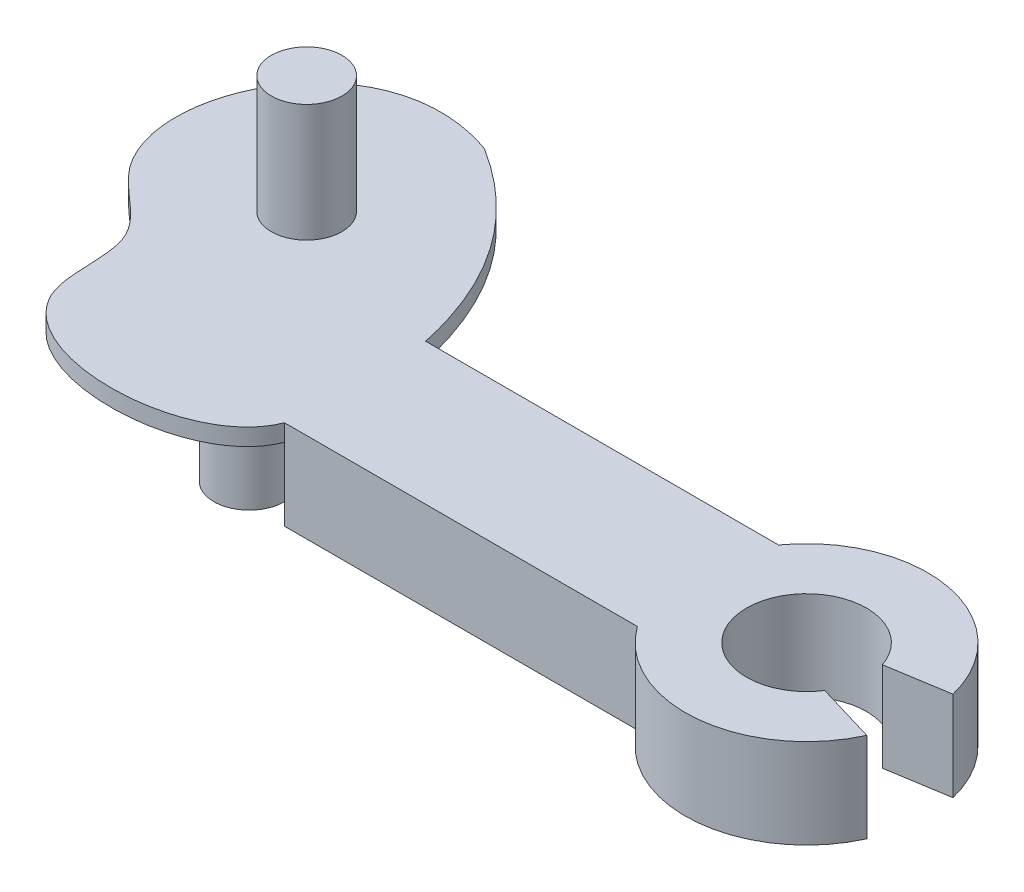
ISO-10303-21;
HEADER;
FILE_DESCRIPTION(('STEP AP214'),'2;1');
FILE_NAME('part.step','',(''),(''),'','','');
FILE_SCHEMA(('AUTOMOTIVE_DESIGN { 1 0 10303 214 1 1 1 1 }'));
ENDSEC;
DATA;
#1=APPLICATION_CONTEXT('core data for automotive mechanical design processes');
#2=APPLICATION_PROTOCOL_DEFINITION('international standard','automotive_design',2000,#1);
#3=PRODUCT_CONTEXT('',#1,'mechanical');
#4=PRODUCT('Part','Part','',(#3));
#5=PRODUCT_RELATED_PRODUCT_CATEGORY('part','',(#4));
#6=PRODUCT_DEFINITION_FORMATION('','',#4);
#7=PRODUCT_DEFINITION_CONTEXT('part definition',#1,'design');
#8=PRODUCT_DEFINITION('design','',#6,#7);
#9=PRODUCT_DEFINITION_SHAPE('','',#8);
#10=(LENGTH_UNIT() NAMED_UNIT(*) SI_UNIT(.MILLI.,.METRE.));
#11=(NAMED_UNIT(*) PLANE_ANGLE_UNIT() SI_UNIT($,.RADIAN.));
#12=(NAMED_UNIT(*) SI_UNIT($,.STERADIAN.) SOLID_ANGLE_UNIT());
#13=UNCERTAINTY_MEASURE_WITH_UNIT(LENGTH_MEASURE(1.E-05),#10,'distance_accuracy_value','');
#14=(GEOMETRIC_REPRESENTATION_CONTEXT(3) GLOBAL_UNCERTAINTY_ASSIGNED_CONTEXT((#13)) GLOBAL_UNIT_ASSIGNED_CONTEXT((#10,
#11,#12)) REPRESENTATION_CONTEXT('',''));
#15=CARTESIAN_POINT('',(0.,0.,0.));
#16=DIRECTION('',(0.,0.,1.));
#17=DIRECTION('',(1.,0.,0.));
#18=AXIS2_PLACEMENT_3D('',#15,#16,#17);
#19=CARTESIAN_POINT('',(0.,0.,0.));
#20=DIRECTION('',(0.,1.,0.));
#21=DIRECTION('',(0.,0.,1.));
#22=AXIS2_PLACEMENT_3D('',#19,#20,#21);
#23=PLANE('',#22);
#24=CARTESIAN_POINT('',(0.,0.,-2.));
#25=CARTESIAN_POINT('',(2.17515280569474,0.,-0.238184258237294));
#26=CARTESIAN_POINT('',(0.,0.,2.));
#27=B_SPLINE_CURVE_WITH_KNOTS('',2,(#24,#25,#26),.UNSPECIFIED.,.F.,.F.,(3,3),(0.,1.),.UNSPECIFIED.);
#28=CARTESIAN_POINT('',(0.,0.,-2.));
#29=VERTEX_POINT('',#28);
#30=CARTESIAN_POINT('',(0.,0.,2.));
#31=VERTEX_POINT('',#30);
#32=EDGE_CURVE('E11',#29,#31,#27,.T.);
#33=ORIENTED_EDGE('',*,*,#32,.F.);
#34=DIRECTION('',(-1.,0.,0.));
#35=VECTOR('',#34,1.);
#36=CARTESIAN_POINT('',(0.,0.,-2.));
#37=LINE('',#36,#35);
#38=CARTESIAN_POINT('',(10.,0.,-2.));
#39=VERTEX_POINT('',#38);
#40=EDGE_CURVE('E155',#39,#29,#37,.T.);
#41=ORIENTED_EDGE('',*,*,#40,.F.);
#42=CARTESIAN_POINT('',(12.794,0.,0.));
#43=DIRECTION('',(0.,1.,0.));
#44=DIRECTION('',(0.,0.,1.));
#45=AXIS2_PLACEMENT_3D('',#42,#43,#44);
#46=CIRCLE('',#45,3.43604947577883);
#47=CARTESIAN_POINT('',(16.1331889635571,0.,-0.810094479464426));
#48=VERTEX_POINT('',#47);
#49=EDGE_CURVE('E152',#39,#48,#46,.F.);
#50=ORIENTED_EDGE('',*,*,#49,.T.);
#51=DIRECTION('',(-0.987239256673568,0.,0.159243995436628));
#52=VECTOR('',#51,1.);
#53=CARTESIAN_POINT('',(0.281759382160779,0.,1.74677809510191));
#54=LINE('',#53,#52);
#55=CARTESIAN_POINT('',(14.408639420947,0.,-0.531920614682185));
#56=VERTEX_POINT('',#55);
#57=EDGE_CURVE('E148',#48,#56,#54,.T.);
#58=ORIENTED_EDGE('',*,*,#57,.T.);
#59=CARTESIAN_POINT('',(12.794,0.,0.));
#60=DIRECTION('',(0.,1.,0.));
#61=DIRECTION('',(0.,0.,1.));
#62=AXIS2_PLACEMENT_3D('',#59,#60,#61);
#63=CIRCLE('',#62,1.7);
#64=CARTESIAN_POINT('',(14.2261023097936,0.,0.916014723835713));
#65=VERTEX_POINT('',#64);
#66=EDGE_CURVE('E145',#65,#56,#63,.F.);
#67=ORIENTED_EDGE('',*,*,#66,.F.);
#68=DIRECTION('',(-0.958395292809104,0.,-0.285444325081709));
#69=VECTOR('',#68,1.);
#70=CARTESIAN_POINT('',(0.908528175015129,0.,-3.05043418211133));
#71=LINE('',#70,#69);
#72=CARTESIAN_POINT('',(15.9223503044234,0.,1.42121791883381));
#73=VERTEX_POINT('',#72);
#74=EDGE_CURVE('E87',#73,#65,#71,.T.);
#75=ORIENTED_EDGE('',*,*,#74,.F.);
#76=CARTESIAN_POINT('',(12.794,0.,0.));
#77=DIRECTION('',(0.,1.,0.));
#78=DIRECTION('',(0.,0.,1.));
#79=AXIS2_PLACEMENT_3D('',#76,#77,#78);
#80=CIRCLE('',#79,3.43604947577883);
#81=CARTESIAN_POINT('',(10.,0.,2.));
#82=VERTEX_POINT('',#81);
#83=EDGE_CURVE('E81',#82,#73,#80,.T.);
#84=ORIENTED_EDGE('',*,*,#83,.F.);
#85=DIRECTION('',(-1.,0.,0.));
#86=VECTOR('',#85,1.);
#87=CARTESIAN_POINT('',(0.,0.,2.));
#88=LINE('',#87,#86);
#89=EDGE_CURVE('E123',#82,#31,#88,.T.);
#90=ORIENTED_EDGE('',*,*,#89,.T.);
#91=EDGE_LOOP('',(#33,#41,#50,#58,#67,#75,#84,#90));
#92=FACE_BOUND('',#91,.T.);
#93=ADVANCED_FACE('F36',(#92),#23,.F.);
#94=CARTESIAN_POINT('',(12.794,2.54,0.));
#95=DIRECTION('',(0.,-1.,0.));
#96=DIRECTION('',(0.,0.,-1.));
#97=AXIS2_PLACEMENT_3D('',#94,#95,#96);
#98=CYLINDRICAL_SURFACE('',#97,1.7);
#99=ORIENTED_EDGE('',*,*,#66,.T.);
#100=DIRECTION('',(0.,-1.,0.));
#101=VECTOR('',#100,1.);
#102=CARTESIAN_POINT('',(14.408639420947,2.54,-0.531920614682185));
#103=LINE('',#102,#101);
#104=CARTESIAN_POINT('',(14.408639420947,2.54,-0.531920614682185));
#105=VERTEX_POINT('',#104);
#106=EDGE_CURVE('E47',#105,#56,#103,.T.);
#107=ORIENTED_EDGE('',*,*,#106,.F.);
#108=CARTESIAN_POINT('',(12.794,2.54,0.));
#109=DIRECTION('',(0.,1.,0.));
#110=DIRECTION('',(0.,0.,1.));
#111=AXIS2_PLACEMENT_3D('',#108,#109,#110);
#112=CIRCLE('',#111,1.7);
#113=CARTESIAN_POINT('',(14.2261023097936,2.54,0.916014723835713));
#114=VERTEX_POINT('',#113);
#115=EDGE_CURVE('E93',#114,#105,#112,.F.);
#116=ORIENTED_EDGE('',*,*,#115,.F.);
#117=DIRECTION('',(0.,-1.,0.));
#118=VECTOR('',#117,1.);
#119=CARTESIAN_POINT('',(14.2261023097936,2.54,0.916014723835713));
#120=LINE('',#119,#118);
#121=EDGE_CURVE('E144',#114,#65,#120,.T.);
#122=ORIENTED_EDGE('',*,*,#121,.T.);
#123=EDGE_LOOP('',(#99,#107,#116,#122));
#124=FACE_BOUND('',#123,.T.);
#125=ADVANCED_FACE('F38',(#124),#98,.F.);
#126=CARTESIAN_POINT('',(0.281759382160779,2.54,1.74677809510191));
#127=DIRECTION('',(0.159243995436628,0.,0.987239256673568));
#128=DIRECTION('',(0.987239256673568,0.,-0.159243995436628));
#129=AXIS2_PLACEMENT_3D('',#126,#127,#128);
#130=PLANE('',#129);
#131=ORIENTED_EDGE('',*,*,#57,.F.);
#132=DIRECTION('',(0.,-1.,0.));
#133=VECTOR('',#132,1.);
#134=CARTESIAN_POINT('',(16.1331889635571,2.54,-0.810094479464426));
#135=LINE('',#134,#133);
#136=CARTESIAN_POINT('',(16.1331889635571,2.54,-0.810094479464426));
#137=VERTEX_POINT('',#136);
#138=EDGE_CURVE('E172',#137,#48,#135,.T.);
#139=ORIENTED_EDGE('',*,*,#138,.F.);
#140=DIRECTION('',(-0.987239256673568,0.,0.159243995436628));
#141=VECTOR('',#140,1.);
#142=CARTESIAN_POINT('',(0.281759382160779,2.54,1.74677809510191));
#143=LINE('',#142,#141);
#144=EDGE_CURVE('E177',#137,#105,#143,.T.);
#145=ORIENTED_EDGE('',*,*,#144,.T.);
#146=ORIENTED_EDGE('',*,*,#106,.T.);
#147=EDGE_LOOP('',(#131,#139,#145,#146));
#148=FACE_BOUND('',#147,.T.);
#149=ADVANCED_FACE('F176',(#148),#130,.T.);
#150=CARTESIAN_POINT('',(12.794,2.54,0.));
#151=DIRECTION('',(0.,-1.,0.));
#152=DIRECTION('',(0.,0.,-1.));
#153=AXIS2_PLACEMENT_3D('',#150,#151,#152);
#154=CYLINDRICAL_SURFACE('',#153,3.43604947577883);
#155=ORIENTED_EDGE('',*,*,#49,.F.);
#156=DIRECTION('',(0.,-1.,0.));
#157=VECTOR('',#156,1.);
#158=CARTESIAN_POINT('',(10.,2.54,-2.));
#159=LINE('',#158,#157);
#160=CARTESIAN_POINT('',(10.,2.54,-2.));
#161=VERTEX_POINT('',#160);
#162=EDGE_CURVE('E170',#161,#39,#159,.T.);
#163=ORIENTED_EDGE('',*,*,#162,.F.);
#164=CARTESIAN_POINT('',(12.794,2.54,0.));
#165=DIRECTION('',(0.,1.,0.));
#166=DIRECTION('',(0.,0.,1.));
#167=AXIS2_PLACEMENT_3D('',#164,#165,#166);
#168=CIRCLE('',#167,3.43604947577883);
#169=EDGE_CURVE('E189',#161,#137,#168,.F.);
#170=ORIENTED_EDGE('',*,*,#169,.T.);
#171=ORIENTED_EDGE('',*,*,#138,.T.);
#172=EDGE_LOOP('',(#155,#163,#170,#171));
#173=FACE_BOUND('',#172,.T.);
#174=ADVANCED_FACE('F185',(#173),#154,.T.);
#175=CARTESIAN_POINT('',(0.,2.54,-2.));
#176=DIRECTION('',(0.,0.,1.));
#177=DIRECTION('',(1.,0.,0.));
#178=AXIS2_PLACEMENT_3D('',#175,#176,#177);
#179=PLANE('',#178);
#180=ORIENTED_EDGE('',*,*,#40,.T.);
#181=DIRECTION('',(0.,1.,0.));
#182=VECTOR('',#181,1.);
#183=CARTESIAN_POINT('',(0.,-3.33,-2.));
#184=LINE('',#183,#182);
#185=CARTESIAN_POINT('',(0.,2.06,-2.));
#186=VERTEX_POINT('',#185);
#187=EDGE_CURVE('E255',#29,#186,#184,.T.);
#188=ORIENTED_EDGE('',*,*,#187,.T.);
#189=DIRECTION('',(0.,-1.,0.));
#190=VECTOR('',#189,1.);
#191=CARTESIAN_POINT('',(0.,2.54,-2.));
#192=LINE('',#191,#190);
#193=CARTESIAN_POINT('',(0.,2.54,-2.));
#194=VERTEX_POINT('',#193);
#195=EDGE_CURVE('E167',#194,#186,#192,.T.);
#196=ORIENTED_EDGE('',*,*,#195,.F.);
#197=DIRECTION('',(-1.,0.,0.));
#198=VECTOR('',#197,1.);
#199=CARTESIAN_POINT('',(0.,2.54,-2.));
#200=LINE('',#199,#198);
#201=EDGE_CURVE('E191',#161,#194,#200,.T.);
#202=ORIENTED_EDGE('',*,*,#201,.F.);
#203=ORIENTED_EDGE('',*,*,#162,.T.);
#204=EDGE_LOOP('',(#180,#188,#196,#202,#203));
#205=FACE_BOUND('',#204,.T.);
#206=ADVANCED_FACE('F209',(#205),#179,.F.);
#207=CARTESIAN_POINT('',(-3.89207128643076,2.54,-7.55845384981425));
#208=CARTESIAN_POINT('',(-0.771451313437752,2.54,-5.60167972688043));
#209=CARTESIAN_POINT('',(0.,2.54,-2.));
#210=B_SPLINE_CURVE_WITH_KNOTS('',2,(#207,#208,#209),.UNSPECIFIED.,.F.,.F.,(3,3),(0.,1.),.UNSPECIFIED.);
#211=DIRECTION('',(0.,-1.,0.));
#212=VECTOR('',#211,1.);
#213=SURFACE_OF_LINEAR_EXTRUSION('',#210,#212);
#214=CARTESIAN_POINT('',(-3.89207128643076,2.06,-7.55845384981425));
#215=CARTESIAN_POINT('',(-0.771451313437752,2.06,-5.60167972688043));
#216=CARTESIAN_POINT('',(0.,2.06,-2.));
#217=B_SPLINE_CURVE_WITH_KNOTS('',2,(#214,#215,#216),.UNSPECIFIED.,.F.,.F.,(3,3),(0.,1.),.UNSPECIFIED.);
#218=CARTESIAN_POINT('',(-3.89207128643076,2.06,-7.55845384981425));
#219=VERTEX_POINT('',#218);
#220=EDGE_CURVE('E249',#219,#186,#217,.T.);
#221=ORIENTED_EDGE('',*,*,#220,.F.);
#222=DIRECTION('',(0.,-1.,0.));
#223=VECTOR('',#222,1.);
#224=CARTESIAN_POINT('',(-3.89207128643076,2.54,-7.55845384981425));
#225=LINE('',#224,#223);
#226=CARTESIAN_POINT('',(-3.89207128643076,2.54,-7.55845384981425));
#227=VERTEX_POINT('',#226);
#228=EDGE_CURVE('E164',#227,#219,#225,.T.);
#229=ORIENTED_EDGE('',*,*,#228,.F.);
#230=EDGE_CURVE('E136',#227,#194,#210,.T.);
#231=ORIENTED_EDGE('',*,*,#230,.T.);
#232=ORIENTED_EDGE('',*,*,#195,.T.);
#233=EDGE_LOOP('',(#221,#229,#231,#232));
#234=FACE_BOUND('',#233,.T.);
#235=ADVANCED_FACE('F204',(#234),#213,.T.);
#236=CARTESIAN_POINT('',(0.,2.54,2.));
#237=CARTESIAN_POINT('',(-0.807019420727667,2.54,4.09860570024204));
#238=CARTESIAN_POINT('',(-7.36080053652823,2.54,4.19627669887293));
#239=CARTESIAN_POINT('',(-6.34345772525978,2.54,-0.548340216859602));
#240=CARTESIAN_POINT('',(-10.7782323983558,2.54,-2.92902577270383));
#241=CARTESIAN_POINT('',(-8.05166562519426,2.54,-9.04548340443192));
#242=CARTESIAN_POINT('',(-3.89207128643076,2.54,-7.55845384981425));
#243=B_SPLINE_CURVE_WITH_KNOTS('',3,(#236,#237,#238,#239,#240,#241,#242),.UNSPECIFIED.,.F.,.F.,
(4,1,1,1,4),(0.,0.355860312878933,0.470047608142096,0.583542680614252,1.),.UNSPECIFIED.);
#244=DIRECTION('',(0.,-1.,0.));
#245=VECTOR('',#244,1.);
#246=SURFACE_OF_LINEAR_EXTRUSION('',#243,#245);
#247=CARTESIAN_POINT('',(0.,2.06,2.));
#248=CARTESIAN_POINT('',(-0.807019420727667,2.06,4.09860570024204));
#249=CARTESIAN_POINT('',(-7.36080053652823,2.06,4.19627669887293));
#250=CARTESIAN_POINT('',(-6.34345772525978,2.06,-0.548340216859602));
#251=CARTESIAN_POINT('',(-10.7782323983558,2.06,-2.92902577270383));
#252=CARTESIAN_POINT('',(-8.05166562519426,2.06,-9.04548340443192));
#253=CARTESIAN_POINT('',(-3.89207128643076,2.06,-7.55845384981425));
#254=B_SPLINE_CURVE_WITH_KNOTS('',3,(#247,#248,#249,#250,#251,#252,#253),.UNSPECIFIED.,.F.,.F.,
(4,1,1,1,4),(0.,0.355860312878933,0.470047608142096,0.583542680614252,1.),.UNSPECIFIED.);
#255=CARTESIAN_POINT('',(0.,2.06,2.));
#256=VERTEX_POINT('',#255);
#257=EDGE_CURVE('E241',#256,#219,#254,.T.);
#258=ORIENTED_EDGE('',*,*,#257,.F.);
#259=DIRECTION('',(0.,-1.,0.));
#260=VECTOR('',#259,1.);
#261=CARTESIAN_POINT('',(0.,2.54,2.));
#262=LINE('',#261,#260);
#263=CARTESIAN_POINT('',(0.,2.54,2.));
#264=VERTEX_POINT('',#263);
#265=EDGE_CURVE('E124',#264,#256,#262,.T.);
#266=ORIENTED_EDGE('',*,*,#265,.F.);
#267=EDGE_CURVE('E134',#264,#227,#243,.T.);
#268=ORIENTED_EDGE('',*,*,#267,.T.);
#269=ORIENTED_EDGE('',*,*,#228,.T.);
#270=EDGE_LOOP('',(#258,#266,#268,#269));
#271=FACE_BOUND('',#270,.T.);
#272=ADVANCED_FACE('F208',(#271),#246,.T.);
#273=CARTESIAN_POINT('',(0.,2.54,2.));
#274=DIRECTION('',(0.,0.,1.));
#275=DIRECTION('',(1.,0.,0.));
#276=AXIS2_PLACEMENT_3D('',#273,#274,#275);
#277=PLANE('',#276);
#278=ORIENTED_EDGE('',*,*,#89,.F.);
#279=DIRECTION('',(0.,-1.,0.));
#280=VECTOR('',#279,1.);
#281=CARTESIAN_POINT('',(10.,2.54,2.));
#282=LINE('',#281,#280);
#283=CARTESIAN_POINT('',(10.,2.54,2.));
#284=VERTEX_POINT('',#283);
#285=EDGE_CURVE('E115',#284,#82,#282,.T.);
#286=ORIENTED_EDGE('',*,*,#285,.F.);
#287=DIRECTION('',(-1.,0.,0.));
#288=VECTOR('',#287,1.);
#289=CARTESIAN_POINT('',(0.,2.54,2.));
#290=LINE('',#289,#288);
#291=EDGE_CURVE('E120',#284,#264,#290,.T.);
#292=ORIENTED_EDGE('',*,*,#291,.T.);
#293=ORIENTED_EDGE('',*,*,#265,.T.);
#294=DIRECTION('',(0.,1.,0.));
#295=VECTOR('',#294,1.);
#296=CARTESIAN_POINT('',(0.,-3.33,2.));
#297=LINE('',#296,#295);
#298=EDGE_CURVE('E250',#31,#256,#297,.T.);
#299=ORIENTED_EDGE('',*,*,#298,.F.);
#300=EDGE_LOOP('',(#278,#286,#292,#293,#299));
#301=FACE_BOUND('',#300,.T.);
#302=ADVANCED_FACE('F117',(#301),#277,.T.);
#303=CARTESIAN_POINT('',(12.794,2.54,0.));
#304=DIRECTION('',(0.,-1.,0.));
#305=DIRECTION('',(0.,0.,-1.));
#306=AXIS2_PLACEMENT_3D('',#303,#304,#305);
#307=CYLINDRICAL_SURFACE('',#306,3.43604947577883);
#308=ORIENTED_EDGE('',*,*,#83,.T.);
#309=DIRECTION('',(0.,-1.,0.));
#310=VECTOR('',#309,1.);
#311=CARTESIAN_POINT('',(15.9223503044234,2.54,1.42121791883381));
#312=LINE('',#311,#310);
#313=CARTESIAN_POINT('',(15.9223503044234,2.54,1.42121791883381));
#314=VERTEX_POINT('',#313);
#315=EDGE_CURVE('E125',#314,#73,#312,.T.);
#316=ORIENTED_EDGE('',*,*,#315,.F.);
#317=CARTESIAN_POINT('',(12.794,2.54,0.));
#318=DIRECTION('',(0.,1.,0.));
#319=DIRECTION('',(0.,0.,1.));
#320=AXIS2_PLACEMENT_3D('',#317,#318,#319);
#321=CIRCLE('',#320,3.43604947577883);
#322=EDGE_CURVE('E127',#284,#314,#321,.T.);
#323=ORIENTED_EDGE('',*,*,#322,.F.);
#324=ORIENTED_EDGE('',*,*,#285,.T.);
#325=EDGE_LOOP('',(#308,#316,#323,#324));
#326=FACE_BOUND('',#325,.T.);
#327=ADVANCED_FACE('F128',(#326),#307,.T.);
#328=CARTESIAN_POINT('',(0.908528175015129,2.54,-3.05043418211133));
#329=DIRECTION('',(-0.285444325081709,0.,0.958395292809104));
#330=DIRECTION('',(0.958395292809104,0.,0.285444325081709));
#331=AXIS2_PLACEMENT_3D('',#328,#329,#330);
#332=PLANE('',#331);
#333=ORIENTED_EDGE('',*,*,#74,.T.);
#334=ORIENTED_EDGE('',*,*,#121,.F.);
#335=DIRECTION('',(-0.958395292809104,0.,-0.285444325081709));
#336=VECTOR('',#335,1.);
#337=CARTESIAN_POINT('',(0.908528175015129,2.54,-3.05043418211133));
#338=LINE('',#337,#336);
#339=EDGE_CURVE('E55',#314,#114,#338,.T.);
#340=ORIENTED_EDGE('',*,*,#339,.F.);
#341=ORIENTED_EDGE('',*,*,#315,.T.);
#342=EDGE_LOOP('',(#333,#334,#340,#341));
#343=FACE_BOUND('',#342,.T.);
#344=ADVANCED_FACE('F227',(#343),#332,.F.);
#345=CARTESIAN_POINT('',(0.,2.54,0.));
#346=DIRECTION('',(0.,1.,0.));
#347=DIRECTION('',(0.,0.,1.));
#348=AXIS2_PLACEMENT_3D('',#345,#346,#347);
#349=PLANE('',#348);
#350=CARTESIAN_POINT('',(-4.87243724358624,2.54,-3.50133621740525));
#351=DIRECTION('',(0.,1.,0.));
#352=DIRECTION('',(0.,0.,1.));
#353=AXIS2_PLACEMENT_3D('',#350,#351,#352);
#354=CIRCLE('',#353,1.);
#355=CARTESIAN_POINT('',(-4.87243724358624,2.54,-2.50133621740525));
#356=VERTEX_POINT('',#355);
#357=EDGE_CURVE('E262',#356,#356,#354,.T.);
#358=ORIENTED_EDGE('',*,*,#357,.F.);
#359=EDGE_LOOP('',(#358));
#360=FACE_BOUND('',#359,.T.);
#361=ORIENTED_EDGE('',*,*,#115,.T.);
#362=ORIENTED_EDGE('',*,*,#144,.F.);
#363=ORIENTED_EDGE('',*,*,#169,.F.);
#364=ORIENTED_EDGE('',*,*,#201,.T.);
#365=ORIENTED_EDGE('',*,*,#230,.F.);
#366=ORIENTED_EDGE('',*,*,#267,.F.);
#367=ORIENTED_EDGE('',*,*,#291,.F.);
#368=ORIENTED_EDGE('',*,*,#322,.T.);
#369=ORIENTED_EDGE('',*,*,#339,.T.);
#370=EDGE_LOOP('',(#361,#362,#363,#364,#365,#366,#367,#368,#369));
#371=FACE_BOUND('',#370,.T.);
#372=ADVANCED_FACE('F131',(#360,#371),#349,.T.);
#373=CARTESIAN_POINT('',(-4.87243724358624,5.87,-3.50133621740525));
#374=DIRECTION('',(0.,-1.,0.));
#375=DIRECTION('',(0.,0.,-1.));
#376=AXIS2_PLACEMENT_3D('',#373,#374,#375);
#377=CYLINDRICAL_SURFACE('',#376,1.);
#378=CARTESIAN_POINT('',(-4.87243724358624,5.87,-3.50133621740525));
#379=DIRECTION('',(0.,1.,0.));
#380=DIRECTION('',(0.,0.,1.));
#381=AXIS2_PLACEMENT_3D('',#378,#379,#380);
#382=CIRCLE('',#381,1.);
#383=CARTESIAN_POINT('',(-4.87243724358624,5.87,-2.50133621740525));
#384=VERTEX_POINT('',#383);
#385=EDGE_CURVE('E149',#384,#384,#382,.T.);
#386=ORIENTED_EDGE('',*,*,#385,.F.);
#387=EDGE_LOOP('',(#386));
#388=FACE_BOUND('',#387,.T.);
#389=ORIENTED_EDGE('',*,*,#357,.T.);
#390=EDGE_LOOP('',(#389));
#391=FACE_BOUND('',#390,.T.);
#392=ADVANCED_FACE('F276',(#388,#391),#377,.T.);
#393=CARTESIAN_POINT('',(-4.87243724358624,5.87,-3.50133621740525));
#394=DIRECTION('',(0.,1.,0.));
#395=DIRECTION('',(0.,0.,1.));
#396=AXIS2_PLACEMENT_3D('',#393,#394,#395);
#397=PLANE('',#396);
#398=ORIENTED_EDGE('',*,*,#385,.T.);
#399=EDGE_LOOP('',(#398));
#400=FACE_BOUND('',#399,.T.);
#401=ADVANCED_FACE('F282',(#400),#397,.T.);
#402=CARTESIAN_POINT('',(0.,-3.33,-2.));
#403=CARTESIAN_POINT('',(2.17515280569474,-3.33,-0.238184258237294));
#404=CARTESIAN_POINT('',(0.,-3.33,2.));
#405=B_SPLINE_CURVE_WITH_KNOTS('',2,(#402,#403,#404),.UNSPECIFIED.,.F.,.F.,(3,3),(0.,1.),.UNSPECIFIED.);
#406=DIRECTION('',(0.,1.,0.));
#407=VECTOR('',#406,1.);
#408=SURFACE_OF_LINEAR_EXTRUSION('',#405,#407);
#409=ORIENTED_EDGE('',*,*,#32,.T.);
#410=ORIENTED_EDGE('',*,*,#298,.T.);
#411=CARTESIAN_POINT('',(0.,2.06,-2.));
#412=CARTESIAN_POINT('',(2.17515280569474,2.06,-0.238184258237294));
#413=CARTESIAN_POINT('',(0.,2.06,2.));
#414=B_SPLINE_CURVE_WITH_KNOTS('',2,(#411,#412,#413),.UNSPECIFIED.,.F.,.F.,(3,3),(0.,1.),.UNSPECIFIED.);
#415=EDGE_CURVE('E309',#186,#256,#414,.T.);
#416=ORIENTED_EDGE('',*,*,#415,.F.);
#417=ORIENTED_EDGE('',*,*,#187,.F.);
#418=EDGE_LOOP('',(#409,#410,#416,#417));
#419=FACE_BOUND('',#418,.T.);
#420=ADVANCED_FACE('F287',(#419),#408,.T.);
#421=CARTESIAN_POINT('',(1.08757640284737,2.06,-0.119092129118647));
#422=DIRECTION('',(0.,1.,0.));
#423=DIRECTION('',(0.,0.,1.));
#424=AXIS2_PLACEMENT_3D('',#421,#422,#423);
#425=PLANE('',#424);
#426=ORIENTED_EDGE('',*,*,#220,.T.);
#427=ORIENTED_EDGE('',*,*,#415,.T.);
#428=ORIENTED_EDGE('',*,*,#257,.T.);
#429=EDGE_LOOP('',(#426,#427,#428));
#430=FACE_BOUND('',#429,.T.);
#431=CARTESIAN_POINT('',(-3.,2.06,0.));
#432=DIRECTION('',(0.,-1.,0.));
#433=DIRECTION('',(0.,0.,-1.));
#434=AXIS2_PLACEMENT_3D('',#431,#432,#433);
#435=CIRCLE('',#434,1.);
#436=CARTESIAN_POINT('',(-3.,2.06,-1.));
#437=VERTEX_POINT('',#436);
#438=EDGE_CURVE('E316',#437,#437,#435,.T.);
#439=ORIENTED_EDGE('',*,*,#438,.F.);
#440=EDGE_LOOP('',(#439));
#441=FACE_BOUND('',#440,.T.);
#442=ADVANCED_FACE('F299',(#430,#441),#425,.F.);
#443=CARTESIAN_POINT('',(-3.,-1.3996,0.));
#444=DIRECTION('',(0.,-1.,0.));
#445=DIRECTION('',(0.,0.,-1.));
#446=AXIS2_PLACEMENT_3D('',#443,#444,#445);
#447=PLANE('',#446);
#448=CARTESIAN_POINT('',(-3.,-1.3996,0.));
#449=DIRECTION('',(0.,-1.,0.));
#450=DIRECTION('',(0.,0.,-1.));
#451=AXIS2_PLACEMENT_3D('',#448,#449,#450);
#452=CIRCLE('',#451,1.);
#453=CARTESIAN_POINT('',(-3.,-1.3996,-1.));
#454=VERTEX_POINT('',#453);
#455=EDGE_CURVE('E259',#454,#454,#452,.T.);
#456=ORIENTED_EDGE('',*,*,#455,.T.);
#457=EDGE_LOOP('',(#456));
#458=FACE_BOUND('',#457,.T.);
#459=ADVANCED_FACE('F295',(#458),#447,.T.);
#460=CARTESIAN_POINT('',(-3.,-1.3996,0.));
#461=DIRECTION('',(0.,1.,0.));
#462=DIRECTION('',(0.,0.,1.));
#463=AXIS2_PLACEMENT_3D('',#460,#461,#462);
#464=CYLINDRICAL_SURFACE('',#463,1.);
#465=ORIENTED_EDGE('',*,*,#455,.F.);
#466=EDGE_LOOP('',(#465));
#467=FACE_BOUND('',#466,.T.);
#468=ORIENTED_EDGE('',*,*,#438,.T.);
#469=EDGE_LOOP('',(#468));
#470=FACE_BOUND('',#469,.T.);
#471=ADVANCED_FACE('F292',(#467,#470),#464,.T.);
#472=CLOSED_SHELL('',(#93,#125,#149,#174,#206,#235,#272,#302,#327,#344,#372,#392,#401,#420,#442,
#459,#471));
#473=MANIFOLD_SOLID_BREP('B2',#472);
#474=ADVANCED_BREP_SHAPE_REPRESENTATION('',(#18,#473),#14);
#475=SHAPE_DEFINITION_REPRESENTATION(#9,#474);
ENDSEC;
END-ISO-10303-21;
